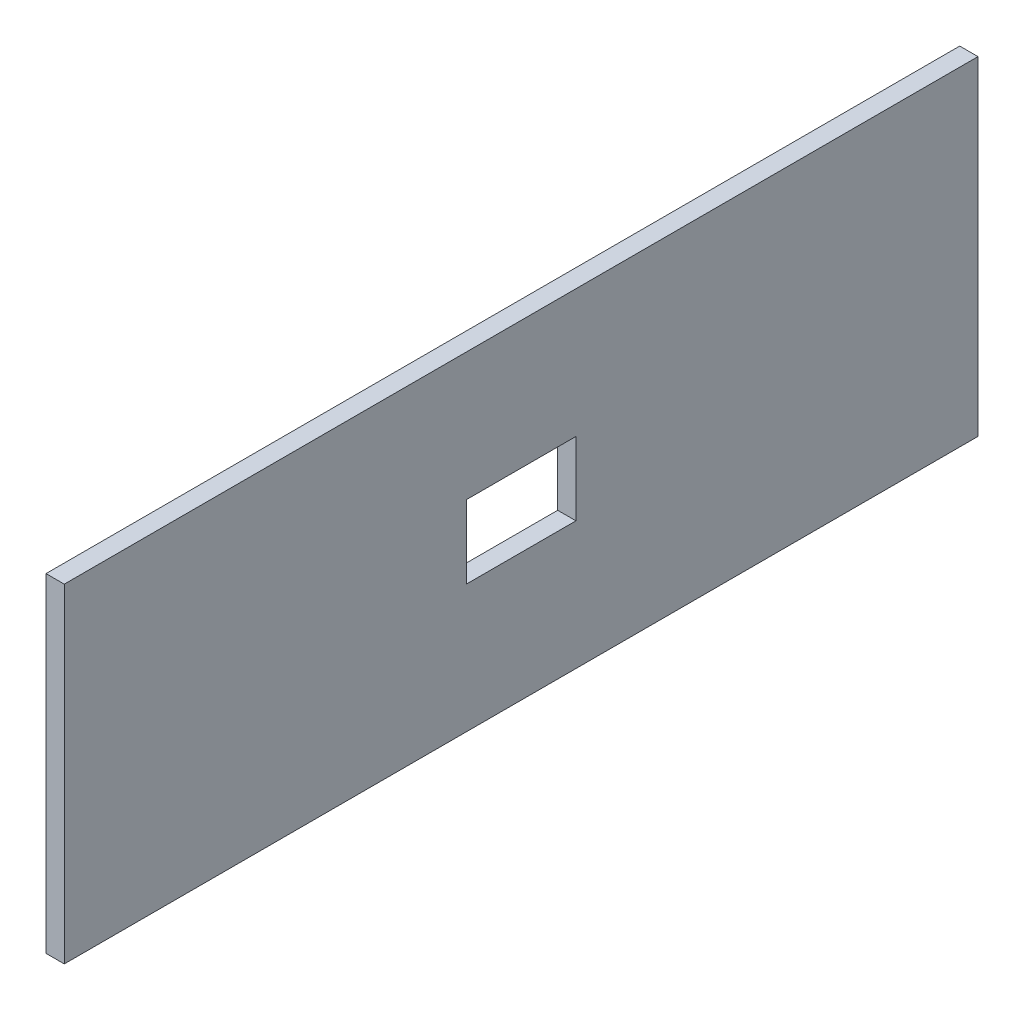
ISO-10303-21;
HEADER;
FILE_DESCRIPTION(('STEP AP214'),'2;1');
FILE_NAME('part.step','',(''),(''),'','','');
FILE_SCHEMA(('AUTOMOTIVE_DESIGN { 1 0 10303 214 1 1 1 1 }'));
ENDSEC;
DATA;
#1=APPLICATION_CONTEXT('core data for automotive mechanical design processes');
#2=APPLICATION_PROTOCOL_DEFINITION('international standard','automotive_design',2000,#1);
#3=PRODUCT_CONTEXT('',#1,'mechanical');
#4=PRODUCT('Part','Part','',(#3));
#5=PRODUCT_RELATED_PRODUCT_CATEGORY('part','',(#4));
#6=PRODUCT_DEFINITION_FORMATION('','',#4);
#7=PRODUCT_DEFINITION_CONTEXT('part definition',#1,'design');
#8=PRODUCT_DEFINITION('design','',#6,#7);
#9=PRODUCT_DEFINITION_SHAPE('','',#8);
#10=(LENGTH_UNIT() NAMED_UNIT(*) SI_UNIT(.MILLI.,.METRE.));
#11=(NAMED_UNIT(*) PLANE_ANGLE_UNIT() SI_UNIT($,.RADIAN.));
#12=(NAMED_UNIT(*) SI_UNIT($,.STERADIAN.) SOLID_ANGLE_UNIT());
#13=UNCERTAINTY_MEASURE_WITH_UNIT(LENGTH_MEASURE(1.E-05),#10,'distance_accuracy_value','');
#14=(GEOMETRIC_REPRESENTATION_CONTEXT(3) GLOBAL_UNCERTAINTY_ASSIGNED_CONTEXT((#13)) GLOBAL_UNIT_ASSIGNED_CONTEXT((#10,
#11,#12)) REPRESENTATION_CONTEXT('',''));
#15=CARTESIAN_POINT('',(0.,0.,0.));
#16=DIRECTION('',(0.,0.,1.));
#17=DIRECTION('',(1.,0.,0.));
#18=AXIS2_PLACEMENT_3D('',#15,#16,#17);
#19=CARTESIAN_POINT('',(5.,45.,-125.));
#20=DIRECTION('',(0.,0.,1.));
#21=DIRECTION('',(1.,0.,0.));
#22=AXIS2_PLACEMENT_3D('',#19,#20,#21);
#23=PLANE('',#22);
#24=DIRECTION('',(0.,1.,0.));
#25=VECTOR('',#24,1.);
#26=CARTESIAN_POINT('',(0.,45.,-125.));
#27=LINE('',#26,#25);
#28=CARTESIAN_POINT('',(0.,-45.,-125.));
#29=VERTEX_POINT('',#28);
#30=CARTESIAN_POINT('',(0.,45.,-125.));
#31=VERTEX_POINT('',#30);
#32=EDGE_CURVE('E138',#29,#31,#27,.T.);
#33=ORIENTED_EDGE('',*,*,#32,.T.);
#34=DIRECTION('',(-1.,0.,0.));
#35=VECTOR('',#34,1.);
#36=CARTESIAN_POINT('',(5.,45.,-125.));
#37=LINE('',#36,#35);
#38=CARTESIAN_POINT('',(5.,45.,-125.));
#39=VERTEX_POINT('',#38);
#40=EDGE_CURVE('E180',#39,#31,#37,.T.);
#41=ORIENTED_EDGE('',*,*,#40,.F.);
#42=DIRECTION('',(0.,1.,0.));
#43=VECTOR('',#42,1.);
#44=CARTESIAN_POINT('',(5.,45.,-125.));
#45=LINE('',#44,#43);
#46=CARTESIAN_POINT('',(5.,-45.,-125.));
#47=VERTEX_POINT('',#46);
#48=EDGE_CURVE('E143',#47,#39,#45,.T.);
#49=ORIENTED_EDGE('',*,*,#48,.F.);
#50=DIRECTION('',(-1.,0.,0.));
#51=VECTOR('',#50,1.);
#52=CARTESIAN_POINT('',(5.,-45.,-125.));
#53=LINE('',#52,#51);
#54=EDGE_CURVE('E157',#47,#29,#53,.T.);
#55=ORIENTED_EDGE('',*,*,#54,.T.);
#56=EDGE_LOOP('',(#33,#41,#49,#55));
#57=FACE_BOUND('',#56,.T.);
#58=ADVANCED_FACE('F42',(#57),#23,.F.);
#59=CARTESIAN_POINT('',(5.,45.,125.));
#60=DIRECTION('',(0.,-1.,0.));
#61=DIRECTION('',(0.,0.,-1.));
#62=AXIS2_PLACEMENT_3D('',#59,#60,#61);
#63=PLANE('',#62);
#64=DIRECTION('',(0.,0.,1.));
#65=VECTOR('',#64,1.);
#66=CARTESIAN_POINT('',(0.,45.,125.));
#67=LINE('',#66,#65);
#68=CARTESIAN_POINT('',(0.,45.,125.));
#69=VERTEX_POINT('',#68);
#70=EDGE_CURVE('E161',#31,#69,#67,.T.);
#71=ORIENTED_EDGE('',*,*,#70,.T.);
#72=DIRECTION('',(-1.,0.,0.));
#73=VECTOR('',#72,1.);
#74=CARTESIAN_POINT('',(5.,45.,125.));
#75=LINE('',#74,#73);
#76=CARTESIAN_POINT('',(5.,45.,125.));
#77=VERTEX_POINT('',#76);
#78=EDGE_CURVE('E176',#77,#69,#75,.T.);
#79=ORIENTED_EDGE('',*,*,#78,.F.);
#80=DIRECTION('',(0.,0.,1.));
#81=VECTOR('',#80,1.);
#82=CARTESIAN_POINT('',(5.,45.,125.));
#83=LINE('',#82,#81);
#84=EDGE_CURVE('E147',#39,#77,#83,.T.);
#85=ORIENTED_EDGE('',*,*,#84,.F.);
#86=ORIENTED_EDGE('',*,*,#40,.T.);
#87=EDGE_LOOP('',(#71,#79,#85,#86));
#88=FACE_BOUND('',#87,.T.);
#89=ADVANCED_FACE('F209',(#88),#63,.F.);
#90=CARTESIAN_POINT('',(5.,45.,125.));
#91=DIRECTION('',(0.,0.,-1.));
#92=DIRECTION('',(-1.,0.,0.));
#93=AXIS2_PLACEMENT_3D('',#90,#91,#92);
#94=PLANE('',#93);
#95=DIRECTION('',(0.,-1.,0.));
#96=VECTOR('',#95,1.);
#97=CARTESIAN_POINT('',(0.,45.,125.));
#98=LINE('',#97,#96);
#99=CARTESIAN_POINT('',(0.,-45.,125.));
#100=VERTEX_POINT('',#99);
#101=EDGE_CURVE('E164',#69,#100,#98,.T.);
#102=ORIENTED_EDGE('',*,*,#101,.T.);
#103=DIRECTION('',(-1.,0.,0.));
#104=VECTOR('',#103,1.);
#105=CARTESIAN_POINT('',(5.,-45.,125.));
#106=LINE('',#105,#104);
#107=CARTESIAN_POINT('',(5.,-45.,125.));
#108=VERTEX_POINT('',#107);
#109=EDGE_CURVE('E172',#108,#100,#106,.T.);
#110=ORIENTED_EDGE('',*,*,#109,.F.);
#111=DIRECTION('',(0.,-1.,0.));
#112=VECTOR('',#111,1.);
#113=CARTESIAN_POINT('',(5.,45.,125.));
#114=LINE('',#113,#112);
#115=EDGE_CURVE('E151',#77,#108,#114,.T.);
#116=ORIENTED_EDGE('',*,*,#115,.F.);
#117=ORIENTED_EDGE('',*,*,#78,.T.);
#118=EDGE_LOOP('',(#102,#110,#116,#117));
#119=FACE_BOUND('',#118,.T.);
#120=ADVANCED_FACE('F214',(#119),#94,.F.);
#121=CARTESIAN_POINT('',(5.,-45.,125.));
#122=DIRECTION('',(0.,1.,0.));
#123=DIRECTION('',(0.,0.,1.));
#124=AXIS2_PLACEMENT_3D('',#121,#122,#123);
#125=PLANE('',#124);
#126=DIRECTION('',(0.,0.,-1.));
#127=VECTOR('',#126,1.);
#128=CARTESIAN_POINT('',(0.,-45.,125.));
#129=LINE('',#128,#127);
#130=EDGE_CURVE('E148',#100,#29,#129,.T.);
#131=ORIENTED_EDGE('',*,*,#130,.T.);
#132=ORIENTED_EDGE('',*,*,#54,.F.);
#133=DIRECTION('',(0.,0.,-1.));
#134=VECTOR('',#133,1.);
#135=CARTESIAN_POINT('',(5.,-45.,125.));
#136=LINE('',#135,#134);
#137=EDGE_CURVE('E154',#108,#47,#136,.T.);
#138=ORIENTED_EDGE('',*,*,#137,.F.);
#139=ORIENTED_EDGE('',*,*,#109,.T.);
#140=EDGE_LOOP('',(#131,#132,#138,#139));
#141=FACE_BOUND('',#140,.T.);
#142=ADVANCED_FACE('F227',(#141),#125,.F.);
#143=CARTESIAN_POINT('',(5.,0.,0.));
#144=DIRECTION('',(1.,0.,0.));
#145=DIRECTION('',(0.,0.,-1.));
#146=AXIS2_PLACEMENT_3D('',#143,#144,#145);
#147=PLANE('',#146);
#148=DIRECTION('',(0.,1.,0.));
#149=VECTOR('',#148,1.);
#150=CARTESIAN_POINT('',(5.,10.,-15.));
#151=LINE('',#150,#149);
#152=CARTESIAN_POINT('',(5.,-10.,-15.));
#153=VERTEX_POINT('',#152);
#154=CARTESIAN_POINT('',(5.,10.,-15.));
#155=VERTEX_POINT('',#154);
#156=EDGE_CURVE('E57',#153,#155,#151,.T.);
#157=ORIENTED_EDGE('',*,*,#156,.F.);
#158=DIRECTION('',(0.,0.,-1.));
#159=VECTOR('',#158,1.);
#160=CARTESIAN_POINT('',(5.,-10.,15.));
#161=LINE('',#160,#159);
#162=CARTESIAN_POINT('',(5.,-10.,15.));
#163=VERTEX_POINT('',#162);
#164=EDGE_CURVE('E128',#163,#153,#161,.T.);
#165=ORIENTED_EDGE('',*,*,#164,.F.);
#166=DIRECTION('',(0.,-1.,0.));
#167=VECTOR('',#166,1.);
#168=CARTESIAN_POINT('',(5.,10.,15.));
#169=LINE('',#168,#167);
#170=CARTESIAN_POINT('',(5.,10.,15.));
#171=VERTEX_POINT('',#170);
#172=EDGE_CURVE('E110',#171,#163,#169,.T.);
#173=ORIENTED_EDGE('',*,*,#172,.F.);
#174=DIRECTION('',(0.,0.,1.));
#175=VECTOR('',#174,1.);
#176=CARTESIAN_POINT('',(5.,10.,15.));
#177=LINE('',#176,#175);
#178=EDGE_CURVE('E120',#155,#171,#177,.T.);
#179=ORIENTED_EDGE('',*,*,#178,.F.);
#180=EDGE_LOOP('',(#157,#165,#173,#179));
#181=FACE_BOUND('',#180,.T.);
#182=ORIENTED_EDGE('',*,*,#48,.T.);
#183=ORIENTED_EDGE('',*,*,#84,.T.);
#184=ORIENTED_EDGE('',*,*,#115,.T.);
#185=ORIENTED_EDGE('',*,*,#137,.T.);
#186=EDGE_LOOP('',(#182,#183,#184,#185));
#187=FACE_BOUND('',#186,.T.);
#188=ADVANCED_FACE('F125',(#181,#187),#147,.T.);
#189=CARTESIAN_POINT('',(0.,0.,0.));
#190=DIRECTION('',(1.,0.,0.));
#191=DIRECTION('',(0.,0.,-1.));
#192=AXIS2_PLACEMENT_3D('',#189,#190,#191);
#193=PLANE('',#192);
#194=DIRECTION('',(0.,0.,-1.));
#195=VECTOR('',#194,1.);
#196=CARTESIAN_POINT('',(0.,-10.,0.));
#197=LINE('',#196,#195);
#198=CARTESIAN_POINT('',(0.,-10.,15.));
#199=VERTEX_POINT('',#198);
#200=CARTESIAN_POINT('',(0.,-10.,-15.));
#201=VERTEX_POINT('',#200);
#202=EDGE_CURVE('E50',#199,#201,#197,.T.);
#203=ORIENTED_EDGE('',*,*,#202,.T.);
#204=DIRECTION('',(0.,1.,0.));
#205=VECTOR('',#204,1.);
#206=CARTESIAN_POINT('',(0.,0.,-15.));
#207=LINE('',#206,#205);
#208=CARTESIAN_POINT('',(0.,10.,-15.));
#209=VERTEX_POINT('',#208);
#210=EDGE_CURVE('E11',#201,#209,#207,.T.);
#211=ORIENTED_EDGE('',*,*,#210,.T.);
#212=DIRECTION('',(0.,0.,1.));
#213=VECTOR('',#212,1.);
#214=CARTESIAN_POINT('',(0.,10.,0.));
#215=LINE('',#214,#213);
#216=CARTESIAN_POINT('',(0.,10.,15.));
#217=VERTEX_POINT('',#216);
#218=EDGE_CURVE('E184',#209,#217,#215,.T.);
#219=ORIENTED_EDGE('',*,*,#218,.T.);
#220=DIRECTION('',(0.,-1.,0.));
#221=VECTOR('',#220,1.);
#222=CARTESIAN_POINT('',(0.,0.,15.));
#223=LINE('',#222,#221);
#224=EDGE_CURVE('E113',#217,#199,#223,.T.);
#225=ORIENTED_EDGE('',*,*,#224,.T.);
#226=EDGE_LOOP('',(#203,#211,#219,#225));
#227=FACE_BOUND('',#226,.T.);
#228=ORIENTED_EDGE('',*,*,#32,.F.);
#229=ORIENTED_EDGE('',*,*,#130,.F.);
#230=ORIENTED_EDGE('',*,*,#101,.F.);
#231=ORIENTED_EDGE('',*,*,#70,.F.);
#232=EDGE_LOOP('',(#228,#229,#230,#231));
#233=FACE_BOUND('',#232,.T.);
#234=ADVANCED_FACE('F191',(#227,#233),#193,.F.);
#235=CARTESIAN_POINT('',(-5.,10.,-15.));
#236=DIRECTION('',(0.,0.,-1.));
#237=DIRECTION('',(0.,1.,0.));
#238=AXIS2_PLACEMENT_3D('',#235,#236,#237);
#239=PLANE('',#238);
#240=DIRECTION('',(1.,0.,0.));
#241=VECTOR('',#240,1.);
#242=CARTESIAN_POINT('',(-5.,-10.,-15.));
#243=LINE('',#242,#241);
#244=EDGE_CURVE('E135',#201,#153,#243,.T.);
#245=ORIENTED_EDGE('',*,*,#244,.T.);
#246=ORIENTED_EDGE('',*,*,#156,.T.);
#247=DIRECTION('',(1.,0.,0.));
#248=VECTOR('',#247,1.);
#249=CARTESIAN_POINT('',(-5.,10.,-15.));
#250=LINE('',#249,#248);
#251=EDGE_CURVE('E117',#209,#155,#250,.T.);
#252=ORIENTED_EDGE('',*,*,#251,.F.);
#253=ORIENTED_EDGE('',*,*,#210,.F.);
#254=EDGE_LOOP('',(#245,#246,#252,#253));
#255=FACE_BOUND('',#254,.T.);
#256=ADVANCED_FACE('F196',(#255),#239,.F.);
#257=CARTESIAN_POINT('',(-5.,-10.,15.));
#258=DIRECTION('',(0.,-1.,0.));
#259=DIRECTION('',(0.,0.,-1.));
#260=AXIS2_PLACEMENT_3D('',#257,#258,#259);
#261=PLANE('',#260);
#262=DIRECTION('',(1.,0.,0.));
#263=VECTOR('',#262,1.);
#264=CARTESIAN_POINT('',(-5.,-10.,15.));
#265=LINE('',#264,#263);
#266=EDGE_CURVE('E116',#199,#163,#265,.T.);
#267=ORIENTED_EDGE('',*,*,#266,.T.);
#268=ORIENTED_EDGE('',*,*,#164,.T.);
#269=ORIENTED_EDGE('',*,*,#244,.F.);
#270=ORIENTED_EDGE('',*,*,#202,.F.);
#271=EDGE_LOOP('',(#267,#268,#269,#270));
#272=FACE_BOUND('',#271,.T.);
#273=ADVANCED_FACE('F195',(#272),#261,.F.);
#274=CARTESIAN_POINT('',(-5.,10.,15.));
#275=DIRECTION('',(0.,0.,1.));
#276=DIRECTION('',(0.,-1.,0.));
#277=AXIS2_PLACEMENT_3D('',#274,#275,#276);
#278=PLANE('',#277);
#279=DIRECTION('',(1.,0.,0.));
#280=VECTOR('',#279,1.);
#281=CARTESIAN_POINT('',(-5.,10.,15.));
#282=LINE('',#281,#280);
#283=EDGE_CURVE('E65',#217,#171,#282,.T.);
#284=ORIENTED_EDGE('',*,*,#283,.T.);
#285=ORIENTED_EDGE('',*,*,#172,.T.);
#286=ORIENTED_EDGE('',*,*,#266,.F.);
#287=ORIENTED_EDGE('',*,*,#224,.F.);
#288=EDGE_LOOP('',(#284,#285,#286,#287));
#289=FACE_BOUND('',#288,.T.);
#290=ADVANCED_FACE('F107',(#289),#278,.F.);
#291=CARTESIAN_POINT('',(-5.,10.,15.));
#292=DIRECTION('',(0.,1.,0.));
#293=DIRECTION('',(0.,0.,1.));
#294=AXIS2_PLACEMENT_3D('',#291,#292,#293);
#295=PLANE('',#294);
#296=ORIENTED_EDGE('',*,*,#251,.T.);
#297=ORIENTED_EDGE('',*,*,#178,.T.);
#298=ORIENTED_EDGE('',*,*,#283,.F.);
#299=ORIENTED_EDGE('',*,*,#218,.F.);
#300=EDGE_LOOP('',(#296,#297,#298,#299));
#301=FACE_BOUND('',#300,.T.);
#302=ADVANCED_FACE('F121',(#301),#295,.F.);
#303=CLOSED_SHELL('',(#58,#89,#120,#142,#188,#234,#256,#273,#290,#302));
#304=MANIFOLD_SOLID_BREP('B2',#303);
#305=ADVANCED_BREP_SHAPE_REPRESENTATION('',(#18,#304),#14);
#306=SHAPE_DEFINITION_REPRESENTATION(#9,#305);
ENDSEC;
END-ISO-10303-21;
